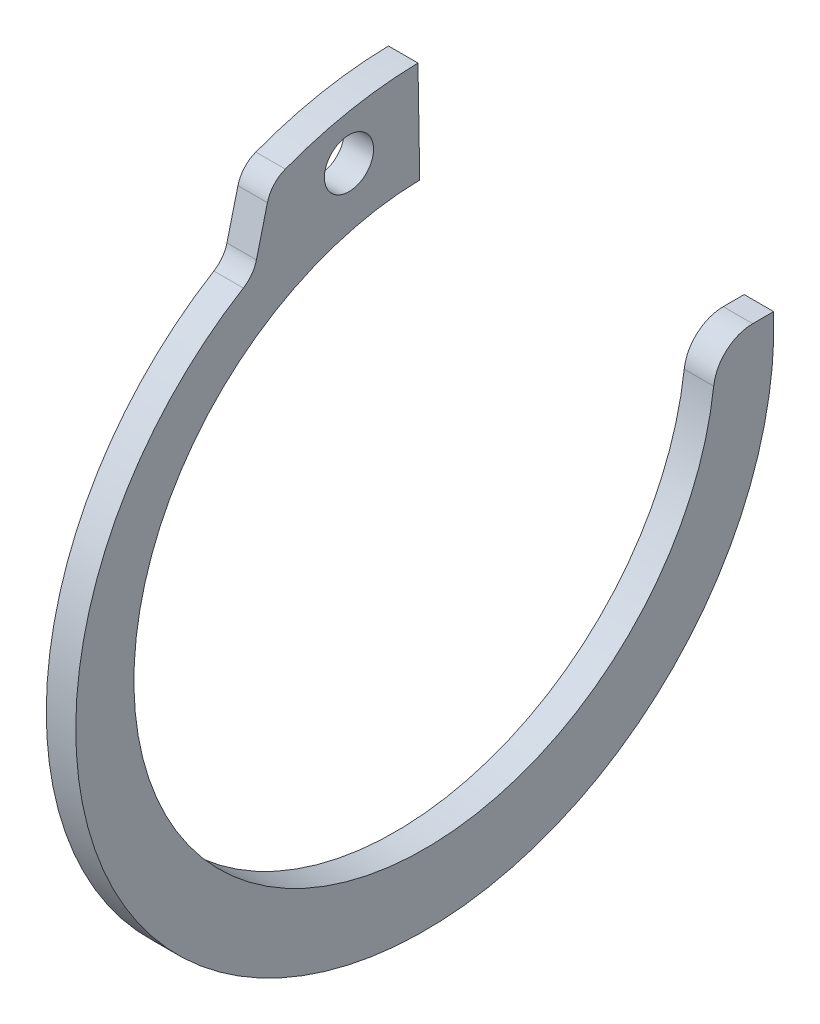
ISO-10303-21;
HEADER;
FILE_DESCRIPTION(('STEP AP214'),'2;1');
FILE_NAME('part.step','',(''),(''),'','','');
FILE_SCHEMA(('AUTOMOTIVE_DESIGN { 1 0 10303 214 1 1 1 1 }'));
ENDSEC;
DATA;
#1=APPLICATION_CONTEXT('core data for automotive mechanical design processes');
#2=APPLICATION_PROTOCOL_DEFINITION('international standard','automotive_design',2000,#1);
#3=PRODUCT_CONTEXT('',#1,'mechanical');
#4=PRODUCT('Part','Part','',(#3));
#5=PRODUCT_RELATED_PRODUCT_CATEGORY('part','',(#4));
#6=PRODUCT_DEFINITION_FORMATION('','',#4);
#7=PRODUCT_DEFINITION_CONTEXT('part definition',#1,'design');
#8=PRODUCT_DEFINITION('design','',#6,#7);
#9=PRODUCT_DEFINITION_SHAPE('','',#8);
#10=(LENGTH_UNIT() NAMED_UNIT(*) SI_UNIT(.MILLI.,.METRE.));
#11=(NAMED_UNIT(*) PLANE_ANGLE_UNIT() SI_UNIT($,.RADIAN.));
#12=(NAMED_UNIT(*) SI_UNIT($,.STERADIAN.) SOLID_ANGLE_UNIT());
#13=UNCERTAINTY_MEASURE_WITH_UNIT(LENGTH_MEASURE(1.E-05),#10,'distance_accuracy_value','');
#14=(GEOMETRIC_REPRESENTATION_CONTEXT(3) GLOBAL_UNCERTAINTY_ASSIGNED_CONTEXT((#13)) GLOBAL_UNIT_ASSIGNED_CONTEXT((#10,
#11,#12)) REPRESENTATION_CONTEXT('',''));
#15=CARTESIAN_POINT('',(0.,0.,0.));
#16=DIRECTION('',(0.,0.,1.));
#17=DIRECTION('',(1.,0.,0.));
#18=AXIS2_PLACEMENT_3D('',#15,#16,#17);
#19=CARTESIAN_POINT('',(0.75,0.,0.));
#20=DIRECTION('',(1.,0.,0.));
#21=DIRECTION('',(0.,0.,-1.));
#22=AXIS2_PLACEMENT_3D('',#19,#20,#21);
#23=PLANE('',#22);
#24=DIRECTION('',(0.,0.,-1.));
#25=VECTOR('',#24,1.);
#26=CARTESIAN_POINT('',(0.75,0.,0.));
#27=LINE('',#26,#25);
#28=CARTESIAN_POINT('',(0.75,0.,-16.6805275695944));
#29=VERTEX_POINT('',#28);
#30=CARTESIAN_POINT('',(0.75,0.,-17.7455152828328));
#31=VERTEX_POINT('',#30);
#32=EDGE_CURVE('E107',#29,#31,#27,.T.);
#33=ORIENTED_EDGE('',*,*,#32,.F.);
#34=CARTESIAN_POINT('',(0.75,-2.00000000000006,-16.6805275695944));
#35=DIRECTION('',(1.,0.,0.));
#36=DIRECTION('',(0.,0.,-1.));
#37=AXIS2_PLACEMENT_3D('',#34,#35,#36);
#38=CIRCLE('',#37,2.);
#39=CARTESIAN_POINT('',(0.75,-1.76190476190481,-14.694750477976));
#40=VERTEX_POINT('',#39);
#41=EDGE_CURVE('E11',#29,#40,#38,.T.);
#42=ORIENTED_EDGE('',*,*,#41,.T.);
#43=CARTESIAN_POINT('',(0.75,0.,0.));
#44=DIRECTION('',(-1.,0.,0.));
#45=DIRECTION('',(0.,0.,-1.));
#46=AXIS2_PLACEMENT_3D('',#43,#44,#45);
#47=CIRCLE('',#46,14.8);
#48=CARTESIAN_POINT('',(0.75,14.7977458883146,0.258295615271796));
#49=VERTEX_POINT('',#48);
#50=EDGE_CURVE('E122',#40,#49,#47,.T.);
#51=ORIENTED_EDGE('',*,*,#50,.T.);
#52=DIRECTION('',(0.,0.999847695156391,0.0174524064372836));
#53=VECTOR('',#52,1.);
#54=CARTESIAN_POINT('',(0.75,14.7977458883146,0.258295615271796));
#55=LINE('',#54,#53);
#56=CARTESIAN_POINT('',(0.75,19.9969539031278,0.349048128745671));
#57=VERTEX_POINT('',#56);
#58=EDGE_CURVE('E125',#49,#57,#55,.T.);
#59=ORIENTED_EDGE('',*,*,#58,.T.);
#60=CARTESIAN_POINT('',(0.75,2.16840434497101E-13,0.));
#61=DIRECTION('',(1.,0.,0.));
#62=DIRECTION('',(0.,0.,-1.));
#63=AXIS2_PLACEMENT_3D('',#60,#61,#62);
#64=CIRCLE('',#63,19.9999999999998);
#65=CARTESIAN_POINT('',(0.75,18.698485706679,7.0969452778729));
#66=VERTEX_POINT('',#65);
#67=EDGE_CURVE('E133',#57,#66,#64,.T.);
#68=ORIENTED_EDGE('',*,*,#67,.T.);
#69=CARTESIAN_POINT('',(0.75,17.3147977643847,6.5717713273103));
#70=DIRECTION('',(1.,0.,0.));
#71=DIRECTION('',(0.,0.,-1.));
#72=AXIS2_PLACEMENT_3D('',#69,#70,#71);
#73=CIRCLE('',#72,1.48);
#74=CARTESIAN_POINT('',(0.75,17.6728421698722,8.00780900219878));
#75=VERTEX_POINT('',#74);
#76=EDGE_CURVE('E157',#66,#75,#73,.T.);
#77=ORIENTED_EDGE('',*,*,#76,.T.);
#78=DIRECTION('',(0.,-0.970295726275997,0.241921895599665));
#79=VECTOR('',#78,1.);
#80=CARTESIAN_POINT('',(0.75,18.4056459299539,7.82510050422163));
#81=LINE('',#80,#79);
#82=CARTESIAN_POINT('',(0.75,15.4311843100688,8.56671707944128));
#83=VERTEX_POINT('',#82);
#84=EDGE_CURVE('E136',#75,#83,#81,.T.);
#85=ORIENTED_EDGE('',*,*,#84,.T.);
#86=CARTESIAN_POINT('',(0.75,15.7892287155563,10.0027547543298));
#87=DIRECTION('',(1.,0.,0.));
#88=DIRECTION('',(0.,0.,-1.));
#89=AXIS2_PLACEMENT_3D('',#86,#87,#88);
#90=CIRCLE('',#89,1.48);
#91=CARTESIAN_POINT('',(0.75,14.5250361437469,9.23319829676353));
#92=VERTEX_POINT('',#91);
#93=EDGE_CURVE('E116',#83,#92,#90,.F.);
#94=ORIENTED_EDGE('',*,*,#93,.T.);
#95=CARTESIAN_POINT('',(0.75,-0.642844764857304,0.));
#96=DIRECTION('',(1.,0.,0.));
#97=DIRECTION('',(0.,0.,-1.));
#98=AXIS2_PLACEMENT_3D('',#95,#96,#97);
#99=CIRCLE('',#98,17.7571552351427);
#100=EDGE_CURVE('E139',#92,#31,#99,.T.);
#101=ORIENTED_EDGE('',*,*,#100,.T.);
#102=EDGE_LOOP('',(#33,#42,#51,#59,#68,#77,#85,#94,#101));
#103=FACE_BOUND('',#102,.T.);
#104=CARTESIAN_POINT('',(0.75,17.335295056159,3.85879124953158));
#105=DIRECTION('',(1.,0.,0.));
#106=DIRECTION('',(0.,0.,-1.));
#107=AXIS2_PLACEMENT_3D('',#104,#105,#106);
#108=CIRCLE('',#107,1.25);
#109=CARTESIAN_POINT('',(0.75,17.335295056159,2.60879124953158));
#110=VERTEX_POINT('',#109);
#111=EDGE_CURVE('E175',#110,#110,#108,.T.);
#112=ORIENTED_EDGE('',*,*,#111,.F.);
#113=EDGE_LOOP('',(#112));
#114=FACE_BOUND('',#113,.T.);
#115=ADVANCED_FACE('F34',(#103,#114),#23,.T.);
#116=CARTESIAN_POINT('',(-0.75,0.,0.));
#117=DIRECTION('',(1.,0.,0.));
#118=DIRECTION('',(0.,0.,-1.));
#119=AXIS2_PLACEMENT_3D('',#116,#117,#118);
#120=PLANE('',#119);
#121=CARTESIAN_POINT('',(-0.75,17.335295056159,3.85879124953158));
#122=DIRECTION('',(1.,0.,0.));
#123=DIRECTION('',(0.,0.,-1.));
#124=AXIS2_PLACEMENT_3D('',#121,#122,#123);
#125=CIRCLE('',#124,1.25);
#126=CARTESIAN_POINT('',(-0.75,17.335295056159,2.60879124953158));
#127=VERTEX_POINT('',#126);
#128=EDGE_CURVE('E106',#127,#127,#125,.T.);
#129=ORIENTED_EDGE('',*,*,#128,.T.);
#130=EDGE_LOOP('',(#129));
#131=FACE_BOUND('',#130,.T.);
#132=CARTESIAN_POINT('',(-0.75,0.,0.));
#133=DIRECTION('',(-1.,0.,0.));
#134=DIRECTION('',(0.,0.,-1.));
#135=AXIS2_PLACEMENT_3D('',#132,#133,#134);
#136=CIRCLE('',#135,14.8);
#137=CARTESIAN_POINT('',(-0.75,-1.76190476190481,-14.694750477976));
#138=VERTEX_POINT('',#137);
#139=CARTESIAN_POINT('',(-0.75,14.7977458883146,0.258295615271796));
#140=VERTEX_POINT('',#139);
#141=EDGE_CURVE('E169',#138,#140,#136,.T.);
#142=ORIENTED_EDGE('',*,*,#141,.F.);
#143=CARTESIAN_POINT('',(-0.75,-2.00000000000006,-16.6805275695944));
#144=DIRECTION('',(1.,0.,0.));
#145=DIRECTION('',(0.,0.,-1.));
#146=AXIS2_PLACEMENT_3D('',#143,#144,#145);
#147=CIRCLE('',#146,2.);
#148=CARTESIAN_POINT('',(-0.75,0.,-16.6805275695944));
#149=VERTEX_POINT('',#148);
#150=EDGE_CURVE('E56',#138,#149,#147,.F.);
#151=ORIENTED_EDGE('',*,*,#150,.T.);
#152=DIRECTION('',(0.,0.,-1.));
#153=VECTOR('',#152,1.);
#154=CARTESIAN_POINT('',(-0.75,0.,0.));
#155=LINE('',#154,#153);
#156=CARTESIAN_POINT('',(-0.75,0.,-17.7455152828328));
#157=VERTEX_POINT('',#156);
#158=EDGE_CURVE('E101',#149,#157,#155,.T.);
#159=ORIENTED_EDGE('',*,*,#158,.T.);
#160=CARTESIAN_POINT('',(-0.75,-0.642844764857304,0.));
#161=DIRECTION('',(1.,0.,0.));
#162=DIRECTION('',(0.,0.,-1.));
#163=AXIS2_PLACEMENT_3D('',#160,#161,#162);
#164=CIRCLE('',#163,17.7571552351427);
#165=CARTESIAN_POINT('',(-0.75,14.5250361437469,9.23319829676353));
#166=VERTEX_POINT('',#165);
#167=EDGE_CURVE('E105',#166,#157,#164,.T.);
#168=ORIENTED_EDGE('',*,*,#167,.F.);
#169=CARTESIAN_POINT('',(-0.75,15.7892287155563,10.0027547543298));
#170=DIRECTION('',(1.,0.,0.));
#171=DIRECTION('',(0.,0.,-1.));
#172=AXIS2_PLACEMENT_3D('',#169,#170,#171);
#173=CIRCLE('',#172,1.48);
#174=CARTESIAN_POINT('',(-0.75,15.4311843100688,8.56671707944128));
#175=VERTEX_POINT('',#174);
#176=EDGE_CURVE('E159',#166,#175,#173,.T.);
#177=ORIENTED_EDGE('',*,*,#176,.T.);
#178=DIRECTION('',(0.,-0.970295726275997,0.241921895599665));
#179=VECTOR('',#178,1.);
#180=CARTESIAN_POINT('',(-0.75,18.4056459299539,7.82510050422163));
#181=LINE('',#180,#179);
#182=CARTESIAN_POINT('',(-0.75,17.6728421698722,8.00780900219878));
#183=VERTEX_POINT('',#182);
#184=EDGE_CURVE('E123',#183,#175,#181,.T.);
#185=ORIENTED_EDGE('',*,*,#184,.F.);
#186=CARTESIAN_POINT('',(-0.75,17.3147977643847,6.5717713273103));
#187=DIRECTION('',(1.,0.,0.));
#188=DIRECTION('',(0.,0.,-1.));
#189=AXIS2_PLACEMENT_3D('',#186,#187,#188);
#190=CIRCLE('',#189,1.48);
#191=CARTESIAN_POINT('',(-0.75,18.698485706679,7.0969452778729));
#192=VERTEX_POINT('',#191);
#193=EDGE_CURVE('E153',#183,#192,#190,.F.);
#194=ORIENTED_EDGE('',*,*,#193,.T.);
#195=CARTESIAN_POINT('',(-0.75,2.16840434497101E-13,0.));
#196=DIRECTION('',(1.,0.,0.));
#197=DIRECTION('',(0.,0.,-1.));
#198=AXIS2_PLACEMENT_3D('',#195,#196,#197);
#199=CIRCLE('',#198,19.9999999999998);
#200=CARTESIAN_POINT('',(-0.75,19.9969539031278,0.349048128745671));
#201=VERTEX_POINT('',#200);
#202=EDGE_CURVE('E128',#201,#192,#199,.T.);
#203=ORIENTED_EDGE('',*,*,#202,.F.);
#204=DIRECTION('',(0.,0.999847695156391,0.0174524064372836));
#205=VECTOR('',#204,1.);
#206=CARTESIAN_POINT('',(-0.75,14.7977458883146,0.258295615271796));
#207=LINE('',#206,#205);
#208=EDGE_CURVE('E174',#140,#201,#207,.T.);
#209=ORIENTED_EDGE('',*,*,#208,.F.);
#210=EDGE_LOOP('',(#142,#151,#159,#168,#177,#185,#194,#203,#209));
#211=FACE_BOUND('',#210,.T.);
#212=ADVANCED_FACE('F103',(#131,#211),#120,.F.);
#213=CARTESIAN_POINT('',(0.75,0.,0.));
#214=DIRECTION('',(-1.,0.,0.));
#215=DIRECTION('',(0.,0.,1.));
#216=AXIS2_PLACEMENT_3D('',#213,#214,#215);
#217=CYLINDRICAL_SURFACE('',#216,14.8);
#218=ORIENTED_EDGE('',*,*,#50,.F.);
#219=DIRECTION('',(-1.,0.,0.));
#220=VECTOR('',#219,1.);
#221=CARTESIAN_POINT('',(0.75,-1.76190476190481,-14.694750477976));
#222=LINE('',#221,#220);
#223=EDGE_CURVE('E115',#40,#138,#222,.T.);
#224=ORIENTED_EDGE('',*,*,#223,.T.);
#225=ORIENTED_EDGE('',*,*,#141,.T.);
#226=DIRECTION('',(-1.,0.,0.));
#227=VECTOR('',#226,1.);
#228=CARTESIAN_POINT('',(0.75,14.7977458883146,0.258295615271796));
#229=LINE('',#228,#227);
#230=EDGE_CURVE('E144',#49,#140,#229,.T.);
#231=ORIENTED_EDGE('',*,*,#230,.F.);
#232=EDGE_LOOP('',(#218,#224,#225,#231));
#233=FACE_BOUND('',#232,.T.);
#234=ADVANCED_FACE('F167',(#233),#217,.F.);
#235=CARTESIAN_POINT('',(0.75,14.7977458883146,0.258295615271796));
#236=DIRECTION('',(0.,-0.0174524064372836,0.999847695156391));
#237=DIRECTION('',(0.,-0.999847695156391,-0.0174524064372836));
#238=AXIS2_PLACEMENT_3D('',#235,#236,#237);
#239=PLANE('',#238);
#240=ORIENTED_EDGE('',*,*,#208,.T.);
#241=DIRECTION('',(-1.,0.,0.));
#242=VECTOR('',#241,1.);
#243=CARTESIAN_POINT('',(0.75,19.9969539031278,0.349048128745671));
#244=LINE('',#243,#242);
#245=EDGE_CURVE('E141',#57,#201,#244,.T.);
#246=ORIENTED_EDGE('',*,*,#245,.F.);
#247=ORIENTED_EDGE('',*,*,#58,.F.);
#248=ORIENTED_EDGE('',*,*,#230,.T.);
#249=EDGE_LOOP('',(#240,#246,#247,#248));
#250=FACE_BOUND('',#249,.T.);
#251=ADVANCED_FACE('F223',(#250),#239,.F.);
#252=CARTESIAN_POINT('',(0.75,2.16840434497101E-13,0.));
#253=DIRECTION('',(-1.,0.,0.));
#254=DIRECTION('',(0.,0.,1.));
#255=AXIS2_PLACEMENT_3D('',#252,#253,#254);
#256=CYLINDRICAL_SURFACE('',#255,19.9999999999998);
#257=ORIENTED_EDGE('',*,*,#202,.T.);
#258=DIRECTION('',(-1.,0.,0.));
#259=VECTOR('',#258,1.);
#260=CARTESIAN_POINT('',(0.75,18.698485706679,7.0969452778729));
#261=LINE('',#260,#259);
#262=EDGE_CURVE('E155',#192,#66,#261,.F.);
#263=ORIENTED_EDGE('',*,*,#262,.T.);
#264=ORIENTED_EDGE('',*,*,#67,.F.);
#265=ORIENTED_EDGE('',*,*,#245,.T.);
#266=EDGE_LOOP('',(#257,#263,#264,#265));
#267=FACE_BOUND('',#266,.T.);
#268=ADVANCED_FACE('F184',(#267),#256,.T.);
#269=CARTESIAN_POINT('',(0.75,18.4056459299539,7.82510050422163));
#270=DIRECTION('',(0.,-0.241921895599665,-0.970295726275997));
#271=DIRECTION('',(0.,0.970295726275997,-0.241921895599665));
#272=AXIS2_PLACEMENT_3D('',#269,#270,#271);
#273=PLANE('',#272);
#274=ORIENTED_EDGE('',*,*,#184,.T.);
#275=DIRECTION('',(1.,0.,0.));
#276=VECTOR('',#275,1.);
#277=CARTESIAN_POINT('',(0.75,15.4311843100688,8.56671707944128));
#278=LINE('',#277,#276);
#279=EDGE_CURVE('E151',#175,#83,#278,.T.);
#280=ORIENTED_EDGE('',*,*,#279,.T.);
#281=ORIENTED_EDGE('',*,*,#84,.F.);
#282=DIRECTION('',(-1.,0.,0.));
#283=VECTOR('',#282,1.);
#284=CARTESIAN_POINT('',(0.75,17.6728421698722,8.00780900219878));
#285=LINE('',#284,#283);
#286=EDGE_CURVE('E148',#75,#183,#285,.T.);
#287=ORIENTED_EDGE('',*,*,#286,.T.);
#288=EDGE_LOOP('',(#274,#280,#281,#287));
#289=FACE_BOUND('',#288,.T.);
#290=ADVANCED_FACE('F196',(#289),#273,.F.);
#291=CARTESIAN_POINT('',(0.75,-0.642844764857304,0.));
#292=DIRECTION('',(-1.,0.,0.));
#293=DIRECTION('',(0.,0.,1.));
#294=AXIS2_PLACEMENT_3D('',#291,#292,#293);
#295=CYLINDRICAL_SURFACE('',#294,17.7571552351427);
#296=ORIENTED_EDGE('',*,*,#167,.T.);
#297=DIRECTION('',(-1.,0.,0.));
#298=VECTOR('',#297,1.);
#299=CARTESIAN_POINT('',(0.75,0.,-17.7455152828328));
#300=LINE('',#299,#298);
#301=EDGE_CURVE('E110',#157,#31,#300,.F.);
#302=ORIENTED_EDGE('',*,*,#301,.T.);
#303=ORIENTED_EDGE('',*,*,#100,.F.);
#304=DIRECTION('',(-1.,0.,0.));
#305=VECTOR('',#304,1.);
#306=CARTESIAN_POINT('',(0.75,14.5250361437469,9.23319829676353));
#307=LINE('',#306,#305);
#308=EDGE_CURVE('E121',#92,#166,#307,.T.);
#309=ORIENTED_EDGE('',*,*,#308,.T.);
#310=EDGE_LOOP('',(#296,#302,#303,#309));
#311=FACE_BOUND('',#310,.T.);
#312=ADVANCED_FACE('F119',(#311),#295,.T.);
#313=CARTESIAN_POINT('',(0.75,17.335295056159,3.85879124953158));
#314=DIRECTION('',(-1.,0.,0.));
#315=DIRECTION('',(0.,0.,1.));
#316=AXIS2_PLACEMENT_3D('',#313,#314,#315);
#317=CYLINDRICAL_SURFACE('',#316,1.25);
#318=ORIENTED_EDGE('',*,*,#111,.T.);
#319=EDGE_LOOP('',(#318));
#320=FACE_BOUND('',#319,.T.);
#321=ORIENTED_EDGE('',*,*,#128,.F.);
#322=EDGE_LOOP('',(#321));
#323=FACE_BOUND('',#322,.T.);
#324=ADVANCED_FACE('F218',(#320,#323),#317,.F.);
#325=CARTESIAN_POINT('',(0.75,15.7892287155563,10.0027547543298));
#326=DIRECTION('',(-1.,0.,0.));
#327=DIRECTION('',(0.,0.,1.));
#328=AXIS2_PLACEMENT_3D('',#325,#326,#327);
#329=CYLINDRICAL_SURFACE('',#328,1.48);
#330=ORIENTED_EDGE('',*,*,#93,.F.);
#331=ORIENTED_EDGE('',*,*,#279,.F.);
#332=ORIENTED_EDGE('',*,*,#176,.F.);
#333=ORIENTED_EDGE('',*,*,#308,.F.);
#334=EDGE_LOOP('',(#330,#331,#332,#333));
#335=FACE_BOUND('',#334,.T.);
#336=ADVANCED_FACE('F200',(#335),#329,.F.);
#337=CARTESIAN_POINT('',(0.75,17.3147977643847,6.5717713273103));
#338=DIRECTION('',(-1.,0.,0.));
#339=DIRECTION('',(0.,0.,1.));
#340=AXIS2_PLACEMENT_3D('',#337,#338,#339);
#341=CYLINDRICAL_SURFACE('',#340,1.48);
#342=ORIENTED_EDGE('',*,*,#76,.F.);
#343=ORIENTED_EDGE('',*,*,#262,.F.);
#344=ORIENTED_EDGE('',*,*,#193,.F.);
#345=ORIENTED_EDGE('',*,*,#286,.F.);
#346=EDGE_LOOP('',(#342,#343,#344,#345));
#347=FACE_BOUND('',#346,.T.);
#348=ADVANCED_FACE('F189',(#347),#341,.T.);
#349=CARTESIAN_POINT('',(-0.75,0.,0.));
#350=DIRECTION('',(0.,-1.,0.));
#351=DIRECTION('',(0.,0.,-1.));
#352=AXIS2_PLACEMENT_3D('',#349,#350,#351);
#353=PLANE('',#352);
#354=ORIENTED_EDGE('',*,*,#158,.F.);
#355=DIRECTION('',(-1.,0.,0.));
#356=VECTOR('',#355,1.);
#357=CARTESIAN_POINT('',(-0.75,0.,-16.6805275695944));
#358=LINE('',#357,#356);
#359=EDGE_CURVE('E42',#149,#29,#358,.F.);
#360=ORIENTED_EDGE('',*,*,#359,.T.);
#361=ORIENTED_EDGE('',*,*,#32,.T.);
#362=ORIENTED_EDGE('',*,*,#301,.F.);
#363=EDGE_LOOP('',(#354,#360,#361,#362));
#364=FACE_BOUND('',#363,.T.);
#365=ADVANCED_FACE('F111',(#364),#353,.F.);
#366=CARTESIAN_POINT('',(0.75,-2.00000000000006,-16.6805275695944));
#367=DIRECTION('',(-1.,0.,0.));
#368=DIRECTION('',(0.,0.,1.));
#369=AXIS2_PLACEMENT_3D('',#366,#367,#368);
#370=CYLINDRICAL_SURFACE('',#369,2.);
#371=ORIENTED_EDGE('',*,*,#41,.F.);
#372=ORIENTED_EDGE('',*,*,#359,.F.);
#373=ORIENTED_EDGE('',*,*,#150,.F.);
#374=ORIENTED_EDGE('',*,*,#223,.F.);
#375=EDGE_LOOP('',(#371,#372,#373,#374));
#376=FACE_BOUND('',#375,.T.);
#377=ADVANCED_FACE('F36',(#376),#370,.T.);
#378=CLOSED_SHELL('',(#115,#212,#234,#251,#268,#290,#312,#324,#336,#348,#365,#377));
#379=MANIFOLD_SOLID_BREP('B2',#378);
#380=ADVANCED_BREP_SHAPE_REPRESENTATION('',(#18,#379),#14);
#381=SHAPE_DEFINITION_REPRESENTATION(#9,#380);
ENDSEC;
END-ISO-10303-21;
